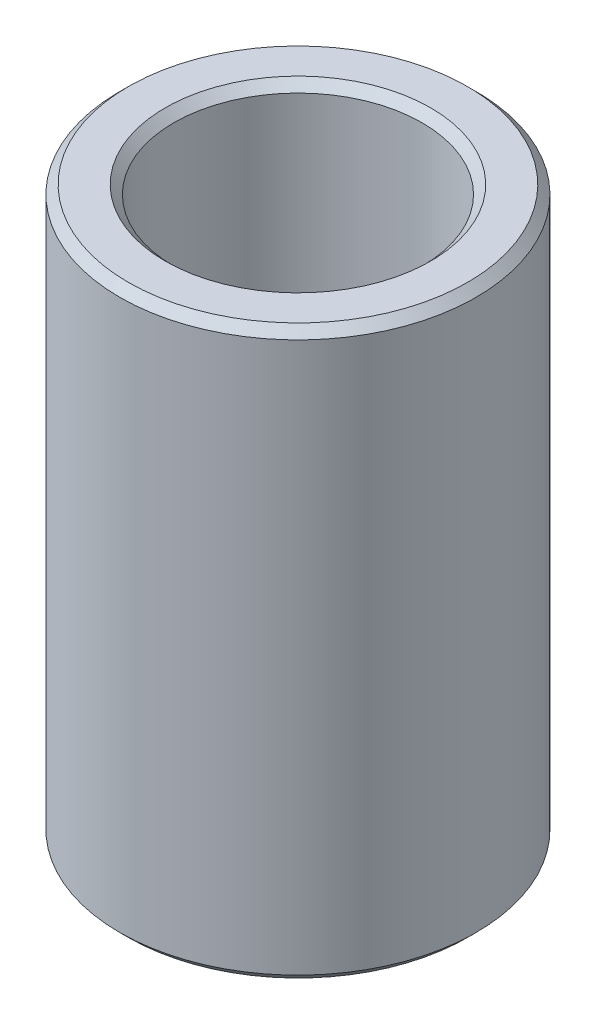
ISO-10303-21;
HEADER;
FILE_DESCRIPTION(('STEP AP214'),'2;1');
FILE_NAME('part.step','',(''),(''),'','','');
FILE_SCHEMA(('AUTOMOTIVE_DESIGN { 1 0 10303 214 1 1 1 1 }'));
ENDSEC;
DATA;
#1=APPLICATION_CONTEXT('core data for automotive mechanical design processes');
#2=APPLICATION_PROTOCOL_DEFINITION('international standard','automotive_design',2000,#1);
#3=PRODUCT_CONTEXT('',#1,'mechanical');
#4=PRODUCT('Part','Part','',(#3));
#5=PRODUCT_RELATED_PRODUCT_CATEGORY('part','',(#4));
#6=PRODUCT_DEFINITION_FORMATION('','',#4);
#7=PRODUCT_DEFINITION_CONTEXT('part definition',#1,'design');
#8=PRODUCT_DEFINITION('design','',#6,#7);
#9=PRODUCT_DEFINITION_SHAPE('','',#8);
#10=(LENGTH_UNIT() NAMED_UNIT(*) SI_UNIT(.MILLI.,.METRE.));
#11=(NAMED_UNIT(*) PLANE_ANGLE_UNIT() SI_UNIT($,.RADIAN.));
#12=(NAMED_UNIT(*) SI_UNIT($,.STERADIAN.) SOLID_ANGLE_UNIT());
#13=UNCERTAINTY_MEASURE_WITH_UNIT(LENGTH_MEASURE(1.E-05),#10,'distance_accuracy_value','');
#14=(GEOMETRIC_REPRESENTATION_CONTEXT(3) GLOBAL_UNCERTAINTY_ASSIGNED_CONTEXT((#13)) GLOBAL_UNIT_ASSIGNED_CONTEXT((#10,
#11,#12)) REPRESENTATION_CONTEXT('',''));
#15=CARTESIAN_POINT('',(0.,0.,0.));
#16=DIRECTION('',(0.,0.,1.));
#17=DIRECTION('',(1.,0.,0.));
#18=AXIS2_PLACEMENT_3D('',#15,#16,#17);
#19=CARTESIAN_POINT('',(0.,167.137593940532,0.));
#20=DIRECTION('',(0.,-1.,0.));
#21=DIRECTION('',(0.,0.,-1.));
#22=AXIS2_PLACEMENT_3D('',#19,#20,#21);
#23=CYLINDRICAL_SURFACE('',#22,52.5);
#24=CARTESIAN_POINT('',(0.,2.53625207286082,0.));
#25=DIRECTION('',(0.,1.,0.));
#26=DIRECTION('',(0.,0.,1.));
#27=AXIS2_PLACEMENT_3D('',#24,#25,#26);
#28=CIRCLE('',#27,52.5);
#29=CARTESIAN_POINT('',(0.,2.53625207286082,52.5));
#30=VERTEX_POINT('',#29);
#31=EDGE_CURVE('E10',#30,#30,#28,.T.);
#32=ORIENTED_EDGE('',*,*,#31,.T.);
#33=EDGE_LOOP('',(#32));
#34=FACE_BOUND('',#33,.T.);
#35=CARTESIAN_POINT('',(0.,164.601341867671,0.));
#36=DIRECTION('',(0.,1.,0.));
#37=DIRECTION('',(0.,0.,1.));
#38=AXIS2_PLACEMENT_3D('',#35,#36,#37);
#39=CIRCLE('',#38,52.5);
#40=CARTESIAN_POINT('',(0.,164.601341867671,52.5));
#41=VERTEX_POINT('',#40);
#42=EDGE_CURVE('E50',#41,#41,#39,.F.);
#43=ORIENTED_EDGE('',*,*,#42,.T.);
#44=EDGE_LOOP('',(#43));
#45=FACE_BOUND('',#44,.T.);
#46=ADVANCED_FACE('F39',(#34,#45),#23,.T.);
#47=CARTESIAN_POINT('',(0.,167.137593940532,0.));
#48=DIRECTION('',(0.,1.,0.));
#49=DIRECTION('',(0.,0.,1.));
#50=AXIS2_PLACEMENT_3D('',#47,#48,#49);
#51=PLANE('',#50);
#52=CARTESIAN_POINT('',(0.,167.137593940532,0.));
#53=DIRECTION('',(0.,1.,0.));
#54=DIRECTION('',(0.,0.,1.));
#55=AXIS2_PLACEMENT_3D('',#52,#53,#54);
#56=CIRCLE('',#55,39.1149139437476);
#57=CARTESIAN_POINT('',(0.,167.137593940532,39.1149139437476));
#58=VERTEX_POINT('',#57);
#59=EDGE_CURVE('E58',#58,#58,#56,.F.);
#60=ORIENTED_EDGE('',*,*,#59,.T.);
#61=EDGE_LOOP('',(#60));
#62=FACE_BOUND('',#61,.T.);
#63=CARTESIAN_POINT('',(0.,167.137593940532,0.));
#64=DIRECTION('',(0.,1.,0.));
#65=DIRECTION('',(0.,0.,1.));
#66=AXIS2_PLACEMENT_3D('',#63,#64,#65);
#67=CIRCLE('',#66,49.9637479271391);
#68=CARTESIAN_POINT('',(0.,167.137593940532,49.9637479271391));
#69=VERTEX_POINT('',#68);
#70=EDGE_CURVE('E61',#69,#69,#67,.T.);
#71=ORIENTED_EDGE('',*,*,#70,.T.);
#72=EDGE_LOOP('',(#71));
#73=FACE_BOUND('',#72,.T.);
#74=ADVANCED_FACE('F88',(#62,#73),#51,.T.);
#75=CARTESIAN_POINT('',(0.,0.,0.));
#76=DIRECTION('',(0.,1.,0.));
#77=DIRECTION('',(0.,0.,1.));
#78=AXIS2_PLACEMENT_3D('',#75,#76,#77);
#79=PLANE('',#78);
#80=CARTESIAN_POINT('',(0.,0.,0.));
#81=DIRECTION('',(0.,1.,0.));
#82=DIRECTION('',(0.,0.,1.));
#83=AXIS2_PLACEMENT_3D('',#80,#81,#82);
#84=CIRCLE('',#83,39.1149139437477);
#85=CARTESIAN_POINT('',(0.,0.,39.1149139437477));
#86=VERTEX_POINT('',#85);
#87=EDGE_CURVE('E51',#86,#86,#84,.T.);
#88=ORIENTED_EDGE('',*,*,#87,.T.);
#89=EDGE_LOOP('',(#88));
#90=FACE_BOUND('',#89,.T.);
#91=CARTESIAN_POINT('',(0.,0.,0.));
#92=DIRECTION('',(0.,1.,0.));
#93=DIRECTION('',(0.,0.,1.));
#94=AXIS2_PLACEMENT_3D('',#91,#92,#93);
#95=CIRCLE('',#94,49.9637479271392);
#96=CARTESIAN_POINT('',(0.,0.,49.9637479271392));
#97=VERTEX_POINT('',#96);
#98=EDGE_CURVE('E54',#97,#97,#95,.F.);
#99=ORIENTED_EDGE('',*,*,#98,.T.);
#100=EDGE_LOOP('',(#99));
#101=FACE_BOUND('',#100,.T.);
#102=ADVANCED_FACE('F83',(#90,#101),#79,.F.);
#103=CARTESIAN_POINT('',(0.,167.137593940532,0.));
#104=DIRECTION('',(0.,-1.,0.));
#105=DIRECTION('',(0.,0.,-1.));
#106=AXIS2_PLACEMENT_3D('',#103,#104,#105);
#107=CYLINDRICAL_SURFACE('',#106,36.5786618708868);
#108=CARTESIAN_POINT('',(0.,164.601341867671,0.));
#109=DIRECTION('',(0.,1.,0.));
#110=DIRECTION('',(0.,0.,1.));
#111=AXIS2_PLACEMENT_3D('',#108,#109,#110);
#112=CIRCLE('',#111,36.5786618708868);
#113=CARTESIAN_POINT('',(0.,164.601341867671,36.5786618708868));
#114=VERTEX_POINT('',#113);
#115=EDGE_CURVE('E67',#114,#114,#112,.T.);
#116=ORIENTED_EDGE('',*,*,#115,.T.);
#117=EDGE_LOOP('',(#116));
#118=FACE_BOUND('',#117,.T.);
#119=CARTESIAN_POINT('',(0.,2.53625207286087,0.));
#120=DIRECTION('',(0.,1.,0.));
#121=DIRECTION('',(0.,0.,1.));
#122=AXIS2_PLACEMENT_3D('',#119,#120,#121);
#123=CIRCLE('',#122,36.5786618708868);
#124=CARTESIAN_POINT('',(0.,2.53625207286087,36.5786618708868));
#125=VERTEX_POINT('',#124);
#126=EDGE_CURVE('E69',#125,#125,#123,.F.);
#127=ORIENTED_EDGE('',*,*,#126,.T.);
#128=EDGE_LOOP('',(#127));
#129=FACE_BOUND('',#128,.T.);
#130=ADVANCED_FACE('F71',(#118,#129),#107,.F.);
#131=CARTESIAN_POINT('',(0.,164.601341867671,0.));
#132=DIRECTION('',(0.,1.,0.));
#133=DIRECTION('',(0.,0.,1.));
#134=AXIS2_PLACEMENT_3D('',#131,#132,#133);
#135=CONICAL_SURFACE('',#134,36.5786618708868,0.785398163397448);
#136=ORIENTED_EDGE('',*,*,#59,.F.);
#137=EDGE_LOOP('',(#136));
#138=FACE_BOUND('',#137,.T.);
#139=ORIENTED_EDGE('',*,*,#115,.F.);
#140=EDGE_LOOP('',(#139));
#141=FACE_BOUND('',#140,.T.);
#142=ADVANCED_FACE('F77',(#138,#141),#135,.F.);
#143=CARTESIAN_POINT('',(0.,0.,0.));
#144=DIRECTION('',(0.,-1.,0.));
#145=DIRECTION('',(0.,0.,-1.));
#146=AXIS2_PLACEMENT_3D('',#143,#144,#145);
#147=CONICAL_SURFACE('',#146,39.1149139437477,0.78539816339744);
#148=ORIENTED_EDGE('',*,*,#126,.F.);
#149=EDGE_LOOP('',(#148));
#150=FACE_BOUND('',#149,.T.);
#151=ORIENTED_EDGE('',*,*,#87,.F.);
#152=EDGE_LOOP('',(#151));
#153=FACE_BOUND('',#152,.T.);
#154=ADVANCED_FACE('F73',(#150,#153),#147,.F.);
#155=CARTESIAN_POINT('',(0.,2.53625207286082,0.));
#156=DIRECTION('',(0.,1.,0.));
#157=DIRECTION('',(0.,0.,1.));
#158=AXIS2_PLACEMENT_3D('',#155,#156,#157);
#159=CONICAL_SURFACE('',#158,52.5,0.785398163397452);
#160=ORIENTED_EDGE('',*,*,#98,.F.);
#161=EDGE_LOOP('',(#160));
#162=FACE_BOUND('',#161,.T.);
#163=ORIENTED_EDGE('',*,*,#31,.F.);
#164=EDGE_LOOP('',(#163));
#165=FACE_BOUND('',#164,.T.);
#166=ADVANCED_FACE('F76',(#162,#165),#159,.T.);
#167=CARTESIAN_POINT('',(0.,167.137593940532,0.));
#168=DIRECTION('',(0.,-1.,0.));
#169=DIRECTION('',(0.,0.,-1.));
#170=AXIS2_PLACEMENT_3D('',#167,#168,#169);
#171=CONICAL_SURFACE('',#170,49.9637479271391,0.785398163397444);
#172=ORIENTED_EDGE('',*,*,#42,.F.);
#173=EDGE_LOOP('',(#172));
#174=FACE_BOUND('',#173,.T.);
#175=ORIENTED_EDGE('',*,*,#70,.F.);
#176=EDGE_LOOP('',(#175));
#177=FACE_BOUND('',#176,.T.);
#178=ADVANCED_FACE('F45',(#174,#177),#171,.T.);
#179=CLOSED_SHELL('',(#46,#74,#102,#130,#142,#154,#166,#178));
#180=MANIFOLD_SOLID_BREP('B2',#179);
#181=ADVANCED_BREP_SHAPE_REPRESENTATION('',(#18,#180),#14);
#182=SHAPE_DEFINITION_REPRESENTATION(#9,#181);
ENDSEC;
END-ISO-10303-21;
